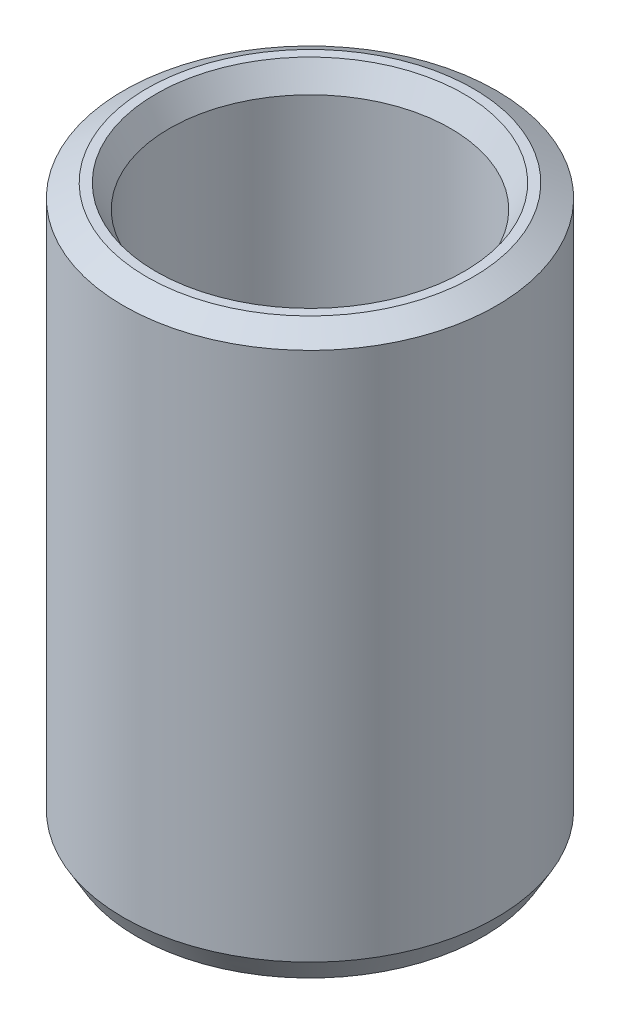
ISO-10303-21;
HEADER;
FILE_DESCRIPTION(('STEP AP214'),'2;1');
FILE_NAME('part.step','',(''),(''),'','','');
FILE_SCHEMA(('AUTOMOTIVE_DESIGN { 1 0 10303 214 1 1 1 1 }'));
ENDSEC;
DATA;
#1=APPLICATION_CONTEXT('core data for automotive mechanical design processes');
#2=APPLICATION_PROTOCOL_DEFINITION('international standard','automotive_design',2000,#1);
#3=PRODUCT_CONTEXT('',#1,'mechanical');
#4=PRODUCT('Part','Part','',(#3));
#5=PRODUCT_RELATED_PRODUCT_CATEGORY('part','',(#4));
#6=PRODUCT_DEFINITION_FORMATION('','',#4);
#7=PRODUCT_DEFINITION_CONTEXT('part definition',#1,'design');
#8=PRODUCT_DEFINITION('design','',#6,#7);
#9=PRODUCT_DEFINITION_SHAPE('','',#8);
#10=(LENGTH_UNIT() NAMED_UNIT(*) SI_UNIT(.MILLI.,.METRE.));
#11=(NAMED_UNIT(*) PLANE_ANGLE_UNIT() SI_UNIT($,.RADIAN.));
#12=(NAMED_UNIT(*) SI_UNIT($,.STERADIAN.) SOLID_ANGLE_UNIT());
#13=UNCERTAINTY_MEASURE_WITH_UNIT(LENGTH_MEASURE(1.E-05),#10,'distance_accuracy_value','');
#14=(GEOMETRIC_REPRESENTATION_CONTEXT(3) GLOBAL_UNCERTAINTY_ASSIGNED_CONTEXT((#13)) GLOBAL_UNIT_ASSIGNED_CONTEXT((#10,
#11,#12)) REPRESENTATION_CONTEXT('',''));
#15=CARTESIAN_POINT('',(0.,0.,0.));
#16=DIRECTION('',(0.,0.,1.));
#17=DIRECTION('',(1.,0.,0.));
#18=AXIS2_PLACEMENT_3D('',#15,#16,#17);
#19=CARTESIAN_POINT('',(0.,83.5476288286109,0.));
#20=DIRECTION('',(0.,-1.,0.));
#21=DIRECTION('',(0.,0.,-1.));
#22=AXIS2_PLACEMENT_3D('',#19,#20,#21);
#23=CYLINDRICAL_SURFACE('',#22,27.5);
#24=CARTESIAN_POINT('',(0.,3.42260930806755,0.));
#25=DIRECTION('',(0.,1.,0.));
#26=DIRECTION('',(0.,0.,1.));
#27=AXIS2_PLACEMENT_3D('',#24,#25,#26);
#28=CIRCLE('',#27,27.5);
#29=CARTESIAN_POINT('',(0.,3.42260930806755,27.5));
#30=VERTEX_POINT('',#29);
#31=EDGE_CURVE('E10',#30,#30,#28,.T.);
#32=ORIENTED_EDGE('',*,*,#31,.T.);
#33=EDGE_LOOP('',(#32));
#34=FACE_BOUND('',#33,.T.);
#35=CARTESIAN_POINT('',(0.,81.5715844232671,0.));
#36=DIRECTION('',(0.,1.,0.));
#37=DIRECTION('',(0.,0.,1.));
#38=AXIS2_PLACEMENT_3D('',#35,#36,#37);
#39=CIRCLE('',#38,27.5);
#40=CARTESIAN_POINT('',(0.,81.5715844232671,27.5));
#41=VERTEX_POINT('',#40);
#42=EDGE_CURVE('E50',#41,#41,#39,.F.);
#43=ORIENTED_EDGE('',*,*,#42,.T.);
#44=EDGE_LOOP('',(#43));
#45=FACE_BOUND('',#44,.T.);
#46=ADVANCED_FACE('F39',(#34,#45),#23,.T.);
#47=CARTESIAN_POINT('',(0.,83.5476288286109,0.));
#48=DIRECTION('',(0.,1.,0.));
#49=DIRECTION('',(0.,0.,1.));
#50=AXIS2_PLACEMENT_3D('',#47,#48,#49);
#51=PLANE('',#50);
#52=CARTESIAN_POINT('',(0.,83.5476288286109,0.));
#53=DIRECTION('',(0.,1.,0.));
#54=DIRECTION('',(0.,0.,1.));
#55=AXIS2_PLACEMENT_3D('',#52,#53,#54);
#56=CIRCLE('',#55,22.7068211159479);
#57=CARTESIAN_POINT('',(0.,83.5476288286109,22.7068211159479));
#58=VERTEX_POINT('',#57);
#59=EDGE_CURVE('E58',#58,#58,#56,.F.);
#60=ORIENTED_EDGE('',*,*,#59,.T.);
#61=EDGE_LOOP('',(#60));
#62=FACE_BOUND('',#61,.T.);
#63=CARTESIAN_POINT('',(0.,83.5476288286109,0.));
#64=DIRECTION('',(0.,1.,0.));
#65=DIRECTION('',(0.,0.,1.));
#66=AXIS2_PLACEMENT_3D('',#63,#64,#65);
#67=CIRCLE('',#66,24.0773906919324);
#68=CARTESIAN_POINT('',(0.,83.5476288286109,24.0773906919324));
#69=VERTEX_POINT('',#68);
#70=EDGE_CURVE('E61',#69,#69,#67,.T.);
#71=ORIENTED_EDGE('',*,*,#70,.T.);
#72=EDGE_LOOP('',(#71));
#73=FACE_BOUND('',#72,.T.);
#74=ADVANCED_FACE('F88',(#62,#73),#51,.T.);
#75=CARTESIAN_POINT('',(0.,0.,0.));
#76=DIRECTION('',(0.,1.,0.));
#77=DIRECTION('',(0.,0.,1.));
#78=AXIS2_PLACEMENT_3D('',#75,#76,#77);
#79=PLANE('',#78);
#80=CARTESIAN_POINT('',(0.,0.,0.));
#81=DIRECTION('',(0.,1.,0.));
#82=DIRECTION('',(0.,0.,1.));
#83=AXIS2_PLACEMENT_3D('',#80,#81,#82);
#84=CIRCLE('',#83,24.1533860186718);
#85=CARTESIAN_POINT('',(0.,0.,24.1533860186718));
#86=VERTEX_POINT('',#85);
#87=EDGE_CURVE('E51',#86,#86,#84,.T.);
#88=ORIENTED_EDGE('',*,*,#87,.T.);
#89=EDGE_LOOP('',(#88));
#90=FACE_BOUND('',#89,.T.);
#91=CARTESIAN_POINT('',(0.,0.,0.));
#92=DIRECTION('',(0.,1.,0.));
#93=DIRECTION('',(0.,0.,1.));
#94=AXIS2_PLACEMENT_3D('',#91,#92,#93);
#95=CIRCLE('',#94,25.5239555946563);
#96=CARTESIAN_POINT('',(0.,0.,25.5239555946563));
#97=VERTEX_POINT('',#96);
#98=EDGE_CURVE('E54',#97,#97,#95,.F.);
#99=ORIENTED_EDGE('',*,*,#98,.T.);
#100=EDGE_LOOP('',(#99));
#101=FACE_BOUND('',#100,.T.);
#102=ADVANCED_FACE('F83',(#90,#101),#79,.F.);
#103=CARTESIAN_POINT('',(0.,83.5476288286109,0.));
#104=DIRECTION('',(0.,-1.,0.));
#105=DIRECTION('',(0.,0.,-1.));
#106=AXIS2_PLACEMENT_3D('',#103,#104,#105);
#107=CYLINDRICAL_SURFACE('',#106,20.7307767106043);
#108=CARTESIAN_POINT('',(0.,80.1250195205434,0.));
#109=DIRECTION('',(0.,1.,0.));
#110=DIRECTION('',(0.,0.,1.));
#111=AXIS2_PLACEMENT_3D('',#108,#109,#110);
#112=CIRCLE('',#111,20.7307767106043);
#113=CARTESIAN_POINT('',(0.,80.1250195205434,20.7307767106042));
#114=VERTEX_POINT('',#113);
#115=EDGE_CURVE('E67',#114,#114,#112,.T.);
#116=ORIENTED_EDGE('',*,*,#115,.T.);
#117=EDGE_LOOP('',(#116));
#118=FACE_BOUND('',#117,.T.);
#119=CARTESIAN_POINT('',(0.,1.97604440534373,0.));
#120=DIRECTION('',(0.,1.,0.));
#121=DIRECTION('',(0.,0.,1.));
#122=AXIS2_PLACEMENT_3D('',#119,#120,#121);
#123=CIRCLE('',#122,20.7307767106043);
#124=CARTESIAN_POINT('',(0.,1.97604440534373,20.7307767106043));
#125=VERTEX_POINT('',#124);
#126=EDGE_CURVE('E69',#125,#125,#123,.F.);
#127=ORIENTED_EDGE('',*,*,#126,.T.);
#128=EDGE_LOOP('',(#127));
#129=FACE_BOUND('',#128,.T.);
#130=ADVANCED_FACE('F71',(#118,#129),#107,.F.);
#131=CARTESIAN_POINT('',(0.,80.1250195205434,0.));
#132=DIRECTION('',(0.,1.,0.));
#133=DIRECTION('',(0.,0.,1.));
#134=AXIS2_PLACEMENT_3D('',#131,#132,#133);
#135=CONICAL_SURFACE('',#134,20.7307767106043,0.523598775598298);
#136=CARTESIAN_POINT('',(0.,83.5476288286109,22.7068211159479));
#137=CARTESIAN_POINT('',(0.,83.5119766483185,22.6862373200589));
#138=CARTESIAN_POINT('',(0.,83.4763244680261,22.6656535241699));
#139=CARTESIAN_POINT('',(0.,83.4050201074414,22.6244859323919));
#140=CARTESIAN_POINT('',(0.,83.369367927149,22.6039021365029));
#141=CARTESIAN_POINT('',(0.,83.2980635665643,22.562734544725));
#142=CARTESIAN_POINT('',(0.,83.2624113862719,22.542150748836));
#143=CARTESIAN_POINT('',(0.,83.1911070256872,22.500983157058));
#144=CARTESIAN_POINT('',(0.,83.1554548453948,22.480399361169));
#145=CARTESIAN_POINT('',(0.,83.0841504848101,22.439231769391));
#146=CARTESIAN_POINT('',(0.,83.0484983045177,22.418647973502));
#147=CARTESIAN_POINT('',(0.,82.9771939439329,22.377480381724));
#148=CARTESIAN_POINT('',(0.,82.9415417636406,22.356896585835));
#149=CARTESIAN_POINT('',(0.,82.8702374030558,22.315728994057));
#150=CARTESIAN_POINT('',(0.,82.8345852227635,22.295145198168));
#151=CARTESIAN_POINT('',(0.,82.7632808621787,22.25397760639));
#152=CARTESIAN_POINT('',(0.,82.7276286818864,22.233393810501));
#153=CARTESIAN_POINT('',(0.,82.6563243213016,22.192226218723));
#154=CARTESIAN_POINT('',(0.,82.6206721410093,22.171642422834));
#155=CARTESIAN_POINT('',(0.,82.5493677804245,22.130474831056));
#156=CARTESIAN_POINT('',(0.,82.5137156001321,22.109891035167));
#157=CARTESIAN_POINT('',(0.,82.4424112395474,22.068723443389));
#158=CARTESIAN_POINT('',(0.,82.406759059255,22.0481396475));
#159=CARTESIAN_POINT('',(0.,82.3354546986703,22.006972055722));
#160=CARTESIAN_POINT('',(0.,82.2998025183779,21.986388259833));
#161=CARTESIAN_POINT('',(0.,82.2284981577932,21.9452206680551));
#162=CARTESIAN_POINT('',(0.,82.1928459775008,21.9246368721661));
#163=CARTESIAN_POINT('',(0.,82.1215416169161,21.8834692803881));
#164=CARTESIAN_POINT('',(0.,82.0858894366237,21.8628854844991));
#165=CARTESIAN_POINT('',(0.,82.014585076039,21.8217178927211));
#166=CARTESIAN_POINT('',(0.,81.9789328957466,21.8011340968321));
#167=CARTESIAN_POINT('',(0.,81.9076285351619,21.7599665050541));
#168=CARTESIAN_POINT('',(0.,81.8719763548695,21.7393827091651));
#169=CARTESIAN_POINT('',(0.,81.8006719942847,21.6982151173871));
#170=CARTESIAN_POINT('',(0.,81.7650198139924,21.6776313214981));
#171=CARTESIAN_POINT('',(0.,81.6937154534076,21.6364637297201));
#172=CARTESIAN_POINT('',(0.,81.6580632731153,21.6158799338311));
#173=CARTESIAN_POINT('',(0.,81.5867589125305,21.5747123420531));
#174=CARTESIAN_POINT('',(0.,81.5511067322382,21.5541285461641));
#175=CARTESIAN_POINT('',(0.,81.4798023716534,21.5129609543861));
#176=CARTESIAN_POINT('',(0.,81.4441501913611,21.4923771584971));
#177=CARTESIAN_POINT('',(0.,81.3728458307763,21.4512095667191));
#178=CARTESIAN_POINT('',(0.,81.3371936504839,21.4306257708301));
#179=CARTESIAN_POINT('',(0.,81.2658892898992,21.3894581790521));
#180=CARTESIAN_POINT('',(0.,81.2302371096068,21.3688743831631));
#181=CARTESIAN_POINT('',(0.,81.1589327490221,21.3277067913852));
#182=CARTESIAN_POINT('',(0.,81.1232805687297,21.3071229954962));
#183=CARTESIAN_POINT('',(0.,81.051976208145,21.2659554037182));
#184=CARTESIAN_POINT('',(0.,81.0163240278526,21.2453716078292));
#185=CARTESIAN_POINT('',(0.,80.9450196672679,21.2042040160512));
#186=CARTESIAN_POINT('',(0.,80.9093674869755,21.1836202201622));
#187=CARTESIAN_POINT('',(0.,80.8380631263908,21.1424526283842));
#188=CARTESIAN_POINT('',(0.,80.8024109460984,21.1218688324952));
#189=CARTESIAN_POINT('',(0.,80.7311065855136,21.0807012407172));
#190=CARTESIAN_POINT('',(0.,80.6954544052213,21.0601174448282));
#191=CARTESIAN_POINT('',(0.,80.6241500446366,21.0189498530502));
#192=CARTESIAN_POINT('',(0.,80.5884978643442,20.9983660571612));
#193=CARTESIAN_POINT('',(0.,80.5171935037594,20.9571984653832));
#194=CARTESIAN_POINT('',(0.,80.4815413234671,20.9366146694942));
#195=CARTESIAN_POINT('',(0.,80.4102369628823,20.8954470777162));
#196=CARTESIAN_POINT('',(0.,80.37458478259,20.8748632818272));
#197=CARTESIAN_POINT('',(0.,80.3032804220052,20.8336956900492));
#198=CARTESIAN_POINT('',(0.,80.2676282417129,20.8131118941602));
#199=CARTESIAN_POINT('',(0.,80.1963238811281,20.7719443023822));
#200=CARTESIAN_POINT('',(0.,80.1606717008357,20.7513605064932));
#201=CARTESIAN_POINT('',(0.,80.1250195205434,20.7307767106042));
#202=B_SPLINE_CURVE_WITH_KNOTS('',3,(#136,#137,#138,#139,#140,#141,#142,#143,#144,#145,#146,
#147,#148,#149,#150,#151,#152,#153,#154,#155,#156,#157,#158,#159,#160,#161,#162,#163,#164,#165,
#166,#167,#168,#169,#170,#171,#172,#173,#174,#175,#176,#177,#178,#179,#180,#181,#182,#183,#184,
#185,#186,#187,#188,#189,#190,#191,#192,#193,#194,#195,#196,#197,#198,#199,#200,#201),
.UNSPECIFIED.,.F.,.F.,(4,2,2,2,2,2,2,2,2,2,2,2,2,2,2,2,2,2,2,2,2,2,2,2,2,2,2,2,2,2,2,2,4),(0.,
0.123502775333983,0.247005550667965,0.370508326001949,0.494011101335932,0.617513876669904,
0.741016652003885,0.864519427337869,0.988022202671852,1.11152497800584,1.23502775333981,
1.35853052867379,1.48203330400777,1.60553607934175,1.72903885467573,1.85254163000971,
1.97604440534369,2.09954718067767,2.22304995601166,2.34655273134563,2.47005550667961,
2.59355828201359,2.71706105734758,2.84056383268155,2.96406660801553,3.08756938334951,
3.2110721586835,3.33457493401748,3.45807770935145,3.58158048468543,3.70508326001942,
3.8285860353534,3.95208881068737),.UNSPECIFIED.);
#203=EDGE_CURVE('BSEAM77',#58,#114,#202,.T.);
#204=ORIENTED_EDGE('',*,*,#59,.F.);
#205=ORIENTED_EDGE('',*,*,#115,.F.);
#206=ORIENTED_EDGE('',*,*,#203,.T.);
#207=ORIENTED_EDGE('',*,*,#203,.F.);
#208=EDGE_LOOP('',(#204,#206,#205,#207));
#209=FACE_BOUND('',#208,.T.);
#210=ADVANCED_FACE('F77',(#209),#135,.F.);
#211=CARTESIAN_POINT('',(0.,0.,0.));
#212=DIRECTION('',(0.,-1.,0.));
#213=DIRECTION('',(0.,0.,-1.));
#214=AXIS2_PLACEMENT_3D('',#211,#212,#213);
#215=CONICAL_SURFACE('',#214,24.1533860186718,1.04719755119659);
#216=ORIENTED_EDGE('',*,*,#126,.F.);
#217=EDGE_LOOP('',(#216));
#218=FACE_BOUND('',#217,.T.);
#219=ORIENTED_EDGE('',*,*,#87,.F.);
#220=EDGE_LOOP('',(#219));
#221=FACE_BOUND('',#220,.T.);
#222=ADVANCED_FACE('F73',(#218,#221),#215,.F.);
#223=CARTESIAN_POINT('',(0.,3.42260930806755,0.));
#224=DIRECTION('',(0.,1.,0.));
#225=DIRECTION('',(0.,0.,1.));
#226=AXIS2_PLACEMENT_3D('',#223,#224,#225);
#227=CONICAL_SURFACE('',#226,27.5,0.523598775598301);
#228=ORIENTED_EDGE('',*,*,#98,.F.);
#229=EDGE_LOOP('',(#228));
#230=FACE_BOUND('',#229,.T.);
#231=ORIENTED_EDGE('',*,*,#31,.F.);
#232=EDGE_LOOP('',(#231));
#233=FACE_BOUND('',#232,.T.);
#234=ADVANCED_FACE('F76',(#230,#233),#227,.T.);
#235=CARTESIAN_POINT('',(0.,83.5476288286109,0.));
#236=DIRECTION('',(0.,-1.,0.));
#237=DIRECTION('',(0.,0.,-1.));
#238=AXIS2_PLACEMENT_3D('',#235,#236,#237);
#239=CONICAL_SURFACE('',#238,24.0773906919324,1.0471975511966);
#240=ORIENTED_EDGE('',*,*,#42,.F.);
#241=EDGE_LOOP('',(#240));
#242=FACE_BOUND('',#241,.T.);
#243=ORIENTED_EDGE('',*,*,#70,.F.);
#244=EDGE_LOOP('',(#243));
#245=FACE_BOUND('',#244,.T.);
#246=ADVANCED_FACE('F45',(#242,#245),#239,.T.);
#247=CLOSED_SHELL('',(#46,#74,#102,#130,#210,#222,#234,#246));
#248=MANIFOLD_SOLID_BREP('B2',#247);
#249=ADVANCED_BREP_SHAPE_REPRESENTATION('',(#18,#248),#14);
#250=SHAPE_DEFINITION_REPRESENTATION(#9,#249);
ENDSEC;
END-ISO-10303-21;
